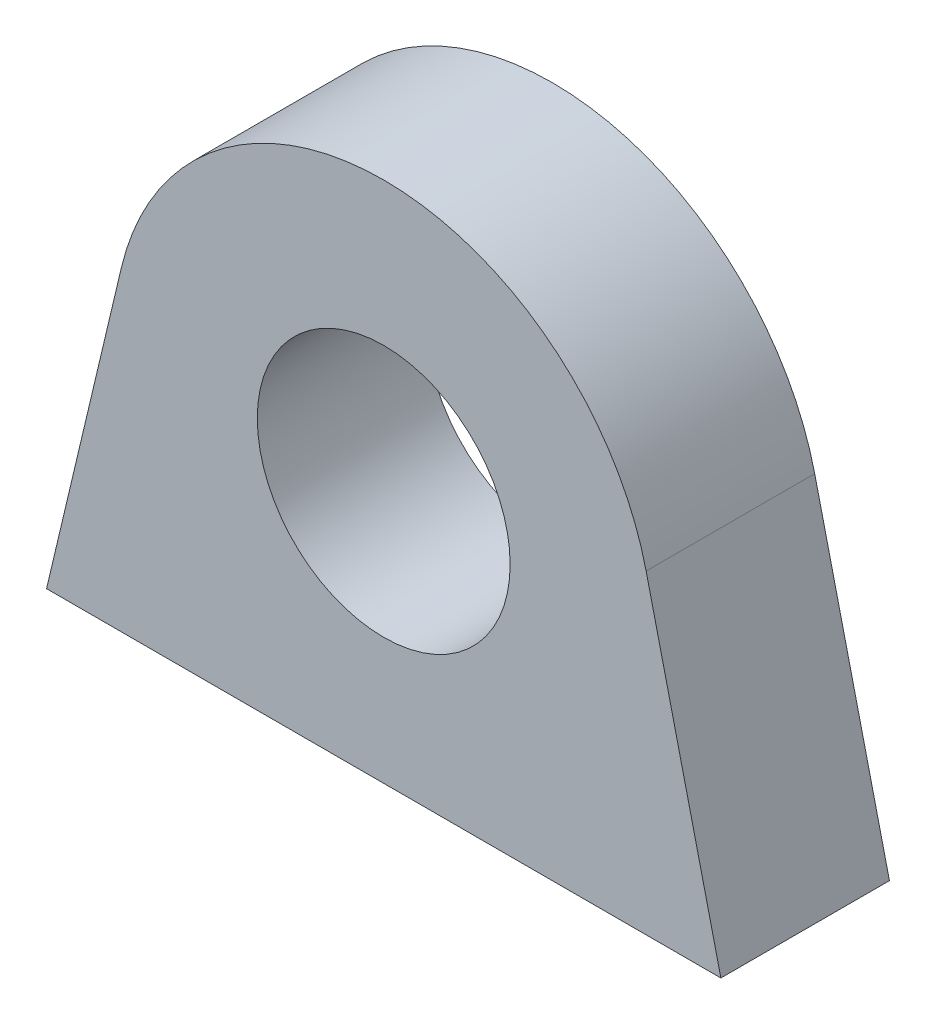
ISO-10303-21;
HEADER;
FILE_DESCRIPTION(('STEP AP214'),'2;1');
FILE_NAME('part.step','',(''),(''),'','','');
FILE_SCHEMA(('AUTOMOTIVE_DESIGN { 1 0 10303 214 1 1 1 1 }'));
ENDSEC;
DATA;
#1=APPLICATION_CONTEXT('core data for automotive mechanical design processes');
#2=APPLICATION_PROTOCOL_DEFINITION('international standard','automotive_design',2000,#1);
#3=PRODUCT_CONTEXT('',#1,'mechanical');
#4=PRODUCT('Part','Part','',(#3));
#5=PRODUCT_RELATED_PRODUCT_CATEGORY('part','',(#4));
#6=PRODUCT_DEFINITION_FORMATION('','',#4);
#7=PRODUCT_DEFINITION_CONTEXT('part definition',#1,'design');
#8=PRODUCT_DEFINITION('design','',#6,#7);
#9=PRODUCT_DEFINITION_SHAPE('','',#8);
#10=(LENGTH_UNIT() NAMED_UNIT(*) SI_UNIT(.MILLI.,.METRE.));
#11=(NAMED_UNIT(*) PLANE_ANGLE_UNIT() SI_UNIT($,.RADIAN.));
#12=(NAMED_UNIT(*) SI_UNIT($,.STERADIAN.) SOLID_ANGLE_UNIT());
#13=UNCERTAINTY_MEASURE_WITH_UNIT(LENGTH_MEASURE(1.E-05),#10,'distance_accuracy_value','');
#14=(GEOMETRIC_REPRESENTATION_CONTEXT(3) GLOBAL_UNCERTAINTY_ASSIGNED_CONTEXT((#13)) GLOBAL_UNIT_ASSIGNED_CONTEXT((#10,
#11,#12)) REPRESENTATION_CONTEXT('',''));
#15=CARTESIAN_POINT('',(0.,0.,0.));
#16=DIRECTION('',(0.,0.,1.));
#17=DIRECTION('',(1.,0.,0.));
#18=AXIS2_PLACEMENT_3D('',#15,#16,#17);
#19=CARTESIAN_POINT('',(0.,15.,10.));
#20=DIRECTION('',(0.,0.,-1.));
#21=DIRECTION('',(-1.,0.,0.));
#22=AXIS2_PLACEMENT_3D('',#19,#20,#21);
#23=PLANE('',#22);
#24=DIRECTION('',(-0.230777210720935,-0.973006618174751,0.));
#25=VECTOR('',#24,1.);
#26=CARTESIAN_POINT('',(-15.5666212799066,18.6920832522856,10.));
#27=LINE('',#26,#25);
#28=CARTESIAN_POINT('',(-15.5666212799066,18.6920832522856,10.));
#29=VERTEX_POINT('',#28);
#30=CARTESIAN_POINT('',(-20.,0.,10.));
#31=VERTEX_POINT('',#30);
#32=EDGE_CURVE('E92',#29,#31,#27,.T.);
#33=ORIENTED_EDGE('',*,*,#32,.T.);
#34=DIRECTION('',(1.,0.,0.));
#35=VECTOR('',#34,1.);
#36=CARTESIAN_POINT('',(-20.,0.,10.));
#37=LINE('',#36,#35);
#38=CARTESIAN_POINT('',(20.,0.,10.));
#39=VERTEX_POINT('',#38);
#40=EDGE_CURVE('E87',#31,#39,#37,.T.);
#41=ORIENTED_EDGE('',*,*,#40,.T.);
#42=DIRECTION('',(-0.230777210720935,0.973006618174751,0.));
#43=VECTOR('',#42,1.);
#44=CARTESIAN_POINT('',(20.,0.,10.));
#45=LINE('',#44,#43);
#46=CARTESIAN_POINT('',(15.5666212799066,18.6920832522856,10.));
#47=VERTEX_POINT('',#46);
#48=EDGE_CURVE('E90',#39,#47,#45,.T.);
#49=ORIENTED_EDGE('',*,*,#48,.T.);
#50=CARTESIAN_POINT('',(0.,15.,10.));
#51=DIRECTION('',(0.,0.,1.));
#52=DIRECTION('',(-1.,0.,0.));
#53=AXIS2_PLACEMENT_3D('',#50,#51,#52);
#54=CIRCLE('',#53,15.998474202681);
#55=EDGE_CURVE('E57',#47,#29,#54,.T.);
#56=ORIENTED_EDGE('',*,*,#55,.T.);
#57=EDGE_LOOP('',(#33,#41,#49,#56));
#58=FACE_BOUND('',#57,.T.);
#59=CARTESIAN_POINT('',(0.,15.,10.));
#60=DIRECTION('',(0.,0.,1.));
#61=DIRECTION('',(1.,0.,0.));
#62=AXIS2_PLACEMENT_3D('',#59,#60,#61);
#63=CIRCLE('',#62,7.5);
#64=CARTESIAN_POINT('',(7.5,15.,10.));
#65=VERTEX_POINT('',#64);
#66=EDGE_CURVE('E112',#65,#65,#63,.T.);
#67=ORIENTED_EDGE('',*,*,#66,.F.);
#68=EDGE_LOOP('',(#67));
#69=FACE_BOUND('',#68,.T.);
#70=ADVANCED_FACE('F39',(#58,#69),#23,.F.);
#71=CARTESIAN_POINT('',(0.,15.,0.));
#72=DIRECTION('',(0.,0.,-1.));
#73=DIRECTION('',(-1.,0.,0.));
#74=AXIS2_PLACEMENT_3D('',#71,#72,#73);
#75=PLANE('',#74);
#76=DIRECTION('',(-0.230777210720935,-0.973006618174751,0.));
#77=VECTOR('',#76,1.);
#78=CARTESIAN_POINT('',(-15.5666212799066,18.6920832522856,0.));
#79=LINE('',#78,#77);
#80=CARTESIAN_POINT('',(-15.5666212799066,18.6920832522856,0.));
#81=VERTEX_POINT('',#80);
#82=CARTESIAN_POINT('',(-20.,0.,0.));
#83=VERTEX_POINT('',#82);
#84=EDGE_CURVE('E108',#81,#83,#79,.T.);
#85=ORIENTED_EDGE('',*,*,#84,.F.);
#86=CARTESIAN_POINT('',(0.,15.,0.));
#87=DIRECTION('',(0.,0.,1.));
#88=DIRECTION('',(-1.,0.,0.));
#89=AXIS2_PLACEMENT_3D('',#86,#87,#88);
#90=CIRCLE('',#89,15.998474202681);
#91=CARTESIAN_POINT('',(15.5666212799066,18.6920832522856,0.));
#92=VERTEX_POINT('',#91);
#93=EDGE_CURVE('E80',#92,#81,#90,.T.);
#94=ORIENTED_EDGE('',*,*,#93,.F.);
#95=DIRECTION('',(-0.230777210720935,0.973006618174751,0.));
#96=VECTOR('',#95,1.);
#97=CARTESIAN_POINT('',(20.,0.,0.));
#98=LINE('',#97,#96);
#99=CARTESIAN_POINT('',(20.,0.,0.));
#100=VERTEX_POINT('',#99);
#101=EDGE_CURVE('E74',#100,#92,#98,.T.);
#102=ORIENTED_EDGE('',*,*,#101,.F.);
#103=DIRECTION('',(1.,0.,0.));
#104=VECTOR('',#103,1.);
#105=CARTESIAN_POINT('',(-20.,0.,0.));
#106=LINE('',#105,#104);
#107=EDGE_CURVE('E97',#83,#100,#106,.T.);
#108=ORIENTED_EDGE('',*,*,#107,.F.);
#109=EDGE_LOOP('',(#85,#94,#102,#108));
#110=FACE_BOUND('',#109,.T.);
#111=CARTESIAN_POINT('',(0.,15.,0.));
#112=DIRECTION('',(0.,0.,1.));
#113=DIRECTION('',(1.,0.,0.));
#114=AXIS2_PLACEMENT_3D('',#111,#112,#113);
#115=CIRCLE('',#114,7.5);
#116=CARTESIAN_POINT('',(7.5,15.,0.));
#117=VERTEX_POINT('',#116);
#118=EDGE_CURVE('E130',#117,#117,#115,.T.);
#119=ORIENTED_EDGE('',*,*,#118,.T.);
#120=EDGE_LOOP('',(#119));
#121=FACE_BOUND('',#120,.T.);
#122=ADVANCED_FACE('F125',(#110,#121),#75,.T.);
#123=CARTESIAN_POINT('',(-15.5666212799066,18.6920832522856,10.));
#124=DIRECTION('',(0.973006618174751,-0.230777210720935,0.));
#125=DIRECTION('',(0.230777210720935,0.973006618174751,0.));
#126=AXIS2_PLACEMENT_3D('',#123,#124,#125);
#127=PLANE('',#126);
#128=ORIENTED_EDGE('',*,*,#84,.T.);
#129=DIRECTION('',(0.,0.,-1.));
#130=VECTOR('',#129,1.);
#131=CARTESIAN_POINT('',(-20.,0.,10.));
#132=LINE('',#131,#130);
#133=EDGE_CURVE('E11',#31,#83,#132,.T.);
#134=ORIENTED_EDGE('',*,*,#133,.F.);
#135=ORIENTED_EDGE('',*,*,#32,.F.);
#136=DIRECTION('',(0.,0.,-1.));
#137=VECTOR('',#136,1.);
#138=CARTESIAN_POINT('',(-15.5666212799066,18.6920832522856,10.));
#139=LINE('',#138,#137);
#140=EDGE_CURVE('E104',#29,#81,#139,.T.);
#141=ORIENTED_EDGE('',*,*,#140,.T.);
#142=EDGE_LOOP('',(#128,#134,#135,#141));
#143=FACE_BOUND('',#142,.T.);
#144=ADVANCED_FACE('F41',(#143),#127,.F.);
#145=CARTESIAN_POINT('',(-20.,0.,10.));
#146=DIRECTION('',(0.,1.,0.));
#147=DIRECTION('',(-1.,0.,0.));
#148=AXIS2_PLACEMENT_3D('',#145,#146,#147);
#149=PLANE('',#148);
#150=ORIENTED_EDGE('',*,*,#107,.T.);
#151=DIRECTION('',(0.,0.,-1.));
#152=VECTOR('',#151,1.);
#153=CARTESIAN_POINT('',(20.,0.,10.));
#154=LINE('',#153,#152);
#155=EDGE_CURVE('E49',#39,#100,#154,.T.);
#156=ORIENTED_EDGE('',*,*,#155,.F.);
#157=ORIENTED_EDGE('',*,*,#40,.F.);
#158=ORIENTED_EDGE('',*,*,#133,.T.);
#159=EDGE_LOOP('',(#150,#156,#157,#158));
#160=FACE_BOUND('',#159,.T.);
#161=ADVANCED_FACE('F96',(#160),#149,.F.);
#162=CARTESIAN_POINT('',(20.,0.,10.));
#163=DIRECTION('',(-0.973006618174751,-0.230777210720935,0.));
#164=DIRECTION('',(0.230777210720935,-0.973006618174751,0.));
#165=AXIS2_PLACEMENT_3D('',#162,#163,#164);
#166=PLANE('',#165);
#167=ORIENTED_EDGE('',*,*,#101,.T.);
#168=DIRECTION('',(0.,0.,-1.));
#169=VECTOR('',#168,1.);
#170=CARTESIAN_POINT('',(15.5666212799066,18.6920832522856,10.));
#171=LINE('',#170,#169);
#172=EDGE_CURVE('E99',#47,#92,#171,.T.);
#173=ORIENTED_EDGE('',*,*,#172,.F.);
#174=ORIENTED_EDGE('',*,*,#48,.F.);
#175=ORIENTED_EDGE('',*,*,#155,.T.);
#176=EDGE_LOOP('',(#167,#173,#174,#175));
#177=FACE_BOUND('',#176,.T.);
#178=ADVANCED_FACE('F100',(#177),#166,.F.);
#179=CARTESIAN_POINT('',(0.,15.,10.));
#180=DIRECTION('',(0.,0.,-1.));
#181=DIRECTION('',(-1.,0.,0.));
#182=AXIS2_PLACEMENT_3D('',#179,#180,#181);
#183=CYLINDRICAL_SURFACE('',#182,15.998474202681);
#184=ORIENTED_EDGE('',*,*,#93,.T.);
#185=ORIENTED_EDGE('',*,*,#140,.F.);
#186=ORIENTED_EDGE('',*,*,#55,.F.);
#187=ORIENTED_EDGE('',*,*,#172,.T.);
#188=EDGE_LOOP('',(#184,#185,#186,#187));
#189=FACE_BOUND('',#188,.T.);
#190=ADVANCED_FACE('F122',(#189),#183,.T.);
#191=CARTESIAN_POINT('',(0.,15.,10.));
#192=DIRECTION('',(0.,0.,-1.));
#193=DIRECTION('',(-1.,0.,0.));
#194=AXIS2_PLACEMENT_3D('',#191,#192,#193);
#195=CYLINDRICAL_SURFACE('',#194,7.5);
#196=ORIENTED_EDGE('',*,*,#66,.T.);
#197=EDGE_LOOP('',(#196));
#198=FACE_BOUND('',#197,.T.);
#199=ORIENTED_EDGE('',*,*,#118,.F.);
#200=EDGE_LOOP('',(#199));
#201=FACE_BOUND('',#200,.T.);
#202=ADVANCED_FACE('F138',(#198,#201),#195,.F.);
#203=CLOSED_SHELL('',(#70,#122,#144,#161,#178,#190,#202));
#204=MANIFOLD_SOLID_BREP('B2',#203);
#205=ADVANCED_BREP_SHAPE_REPRESENTATION('',(#18,#204),#14);
#206=SHAPE_DEFINITION_REPRESENTATION(#9,#205);
ENDSEC;
END-ISO-10303-21;
